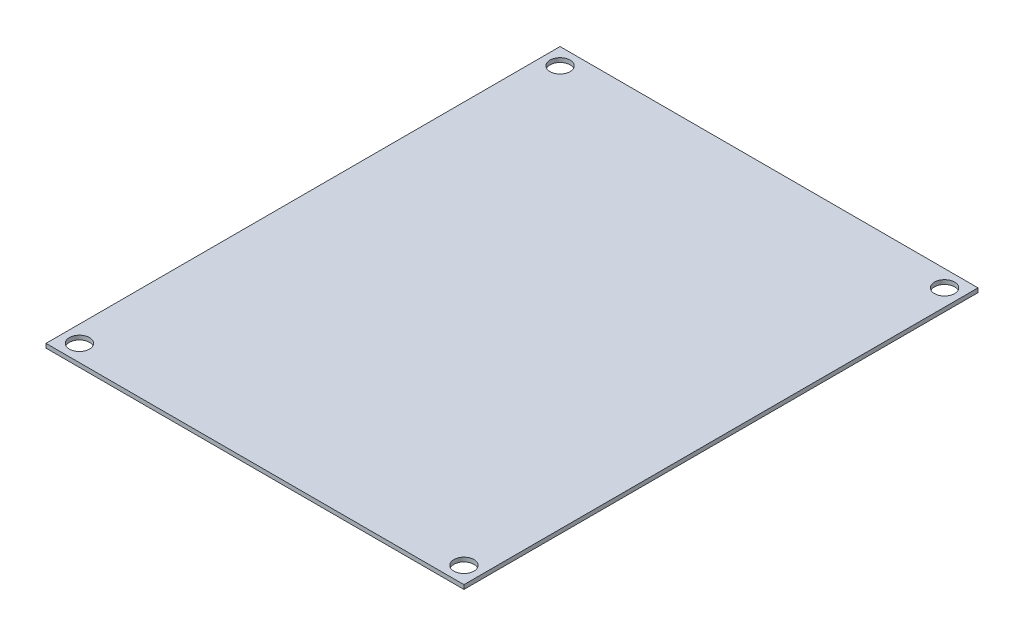
ISO-10303-21;
HEADER;
FILE_DESCRIPTION(('STEP AP214'),'2;1');
FILE_NAME('part.step','',(''),(''),'','','');
FILE_SCHEMA(('AUTOMOTIVE_DESIGN { 1 0 10303 214 1 1 1 1 }'));
ENDSEC;
DATA;
#1=APPLICATION_CONTEXT('core data for automotive mechanical design processes');
#2=APPLICATION_PROTOCOL_DEFINITION('international standard','automotive_design',2000,#1);
#3=PRODUCT_CONTEXT('',#1,'mechanical');
#4=PRODUCT('Part','Part','',(#3));
#5=PRODUCT_RELATED_PRODUCT_CATEGORY('part','',(#4));
#6=PRODUCT_DEFINITION_FORMATION('','',#4);
#7=PRODUCT_DEFINITION_CONTEXT('part definition',#1,'design');
#8=PRODUCT_DEFINITION('design','',#6,#7);
#9=PRODUCT_DEFINITION_SHAPE('','',#8);
#10=(LENGTH_UNIT() NAMED_UNIT(*) SI_UNIT(.MILLI.,.METRE.));
#11=(NAMED_UNIT(*) PLANE_ANGLE_UNIT() SI_UNIT($,.RADIAN.));
#12=(NAMED_UNIT(*) SI_UNIT($,.STERADIAN.) SOLID_ANGLE_UNIT());
#13=UNCERTAINTY_MEASURE_WITH_UNIT(LENGTH_MEASURE(1.E-05),#10,'distance_accuracy_value','');
#14=(GEOMETRIC_REPRESENTATION_CONTEXT(3) GLOBAL_UNCERTAINTY_ASSIGNED_CONTEXT((#13)) GLOBAL_UNIT_ASSIGNED_CONTEXT((#10,
#11,#12)) REPRESENTATION_CONTEXT('',''));
#15=CARTESIAN_POINT('',(0.,0.,0.));
#16=DIRECTION('',(0.,0.,1.));
#17=DIRECTION('',(1.,0.,0.));
#18=AXIS2_PLACEMENT_3D('',#15,#16,#17);
#19=CARTESIAN_POINT('',(-50.,1.,-61.5));
#20=DIRECTION('',(1.,0.,0.));
#21=DIRECTION('',(0.,0.,-1.));
#22=AXIS2_PLACEMENT_3D('',#19,#20,#21);
#23=PLANE('',#22);
#24=DIRECTION('',(0.,0.,1.));
#25=VECTOR('',#24,1.);
#26=CARTESIAN_POINT('',(-50.,0.,-61.5));
#27=LINE('',#26,#25);
#28=CARTESIAN_POINT('',(-50.,0.,-61.5));
#29=VERTEX_POINT('',#28);
#30=CARTESIAN_POINT('',(-50.,0.,61.5));
#31=VERTEX_POINT('',#30);
#32=EDGE_CURVE('E96',#29,#31,#27,.T.);
#33=ORIENTED_EDGE('',*,*,#32,.T.);
#34=DIRECTION('',(0.,-1.,0.));
#35=VECTOR('',#34,1.);
#36=CARTESIAN_POINT('',(-50.,1.,61.5));
#37=LINE('',#36,#35);
#38=CARTESIAN_POINT('',(-50.,1.,61.5));
#39=VERTEX_POINT('',#38);
#40=EDGE_CURVE('E11',#39,#31,#37,.T.);
#41=ORIENTED_EDGE('',*,*,#40,.F.);
#42=DIRECTION('',(0.,0.,1.));
#43=VECTOR('',#42,1.);
#44=CARTESIAN_POINT('',(-50.,1.,-61.5));
#45=LINE('',#44,#43);
#46=CARTESIAN_POINT('',(-50.,1.,-61.5));
#47=VERTEX_POINT('',#46);
#48=EDGE_CURVE('E84',#47,#39,#45,.T.);
#49=ORIENTED_EDGE('',*,*,#48,.F.);
#50=DIRECTION('',(0.,-1.,0.));
#51=VECTOR('',#50,1.);
#52=CARTESIAN_POINT('',(-50.,1.,-61.5));
#53=LINE('',#52,#51);
#54=EDGE_CURVE('E92',#47,#29,#53,.T.);
#55=ORIENTED_EDGE('',*,*,#54,.T.);
#56=EDGE_LOOP('',(#33,#41,#49,#55));
#57=FACE_BOUND('',#56,.T.);
#58=ADVANCED_FACE('F33',(#57),#23,.F.);
#59=CARTESIAN_POINT('',(50.,1.,61.5));
#60=DIRECTION('',(0.,0.,-1.));
#61=DIRECTION('',(-1.,0.,0.));
#62=AXIS2_PLACEMENT_3D('',#59,#60,#61);
#63=PLANE('',#62);
#64=DIRECTION('',(1.,0.,0.));
#65=VECTOR('',#64,1.);
#66=CARTESIAN_POINT('',(50.,0.,61.5));
#67=LINE('',#66,#65);
#68=CARTESIAN_POINT('',(50.,0.,61.5));
#69=VERTEX_POINT('',#68);
#70=EDGE_CURVE('E88',#31,#69,#67,.T.);
#71=ORIENTED_EDGE('',*,*,#70,.T.);
#72=DIRECTION('',(0.,-1.,0.));
#73=VECTOR('',#72,1.);
#74=CARTESIAN_POINT('',(50.,1.,61.5));
#75=LINE('',#74,#73);
#76=CARTESIAN_POINT('',(50.,1.,61.5));
#77=VERTEX_POINT('',#76);
#78=EDGE_CURVE('E41',#77,#69,#75,.T.);
#79=ORIENTED_EDGE('',*,*,#78,.F.);
#80=DIRECTION('',(1.,0.,0.));
#81=VECTOR('',#80,1.);
#82=CARTESIAN_POINT('',(50.,1.,61.5));
#83=LINE('',#82,#81);
#84=EDGE_CURVE('E79',#39,#77,#83,.T.);
#85=ORIENTED_EDGE('',*,*,#84,.F.);
#86=ORIENTED_EDGE('',*,*,#40,.T.);
#87=EDGE_LOOP('',(#71,#79,#85,#86));
#88=FACE_BOUND('',#87,.T.);
#89=ADVANCED_FACE('F87',(#88),#63,.F.);
#90=CARTESIAN_POINT('',(50.,1.,-61.5));
#91=DIRECTION('',(-1.,0.,0.));
#92=DIRECTION('',(0.,0.,1.));
#93=AXIS2_PLACEMENT_3D('',#90,#91,#92);
#94=PLANE('',#93);
#95=DIRECTION('',(0.,0.,-1.));
#96=VECTOR('',#95,1.);
#97=CARTESIAN_POINT('',(50.,0.,-61.5));
#98=LINE('',#97,#96);
#99=CARTESIAN_POINT('',(50.,0.,-61.5));
#100=VERTEX_POINT('',#99);
#101=EDGE_CURVE('E66',#69,#100,#98,.T.);
#102=ORIENTED_EDGE('',*,*,#101,.T.);
#103=DIRECTION('',(0.,-1.,0.));
#104=VECTOR('',#103,1.);
#105=CARTESIAN_POINT('',(50.,1.,-61.5));
#106=LINE('',#105,#104);
#107=CARTESIAN_POINT('',(50.,1.,-61.5));
#108=VERTEX_POINT('',#107);
#109=EDGE_CURVE('E89',#108,#100,#106,.T.);
#110=ORIENTED_EDGE('',*,*,#109,.F.);
#111=DIRECTION('',(0.,0.,-1.));
#112=VECTOR('',#111,1.);
#113=CARTESIAN_POINT('',(50.,1.,-61.5));
#114=LINE('',#113,#112);
#115=EDGE_CURVE('E82',#77,#108,#114,.T.);
#116=ORIENTED_EDGE('',*,*,#115,.F.);
#117=ORIENTED_EDGE('',*,*,#78,.T.);
#118=EDGE_LOOP('',(#102,#110,#116,#117));
#119=FACE_BOUND('',#118,.T.);
#120=ADVANCED_FACE('F90',(#119),#94,.F.);
#121=CARTESIAN_POINT('',(50.,1.,-61.5));
#122=DIRECTION('',(0.,0.,1.));
#123=DIRECTION('',(1.,0.,0.));
#124=AXIS2_PLACEMENT_3D('',#121,#122,#123);
#125=PLANE('',#124);
#126=DIRECTION('',(-1.,0.,0.));
#127=VECTOR('',#126,1.);
#128=CARTESIAN_POINT('',(50.,0.,-61.5));
#129=LINE('',#128,#127);
#130=EDGE_CURVE('E72',#100,#29,#129,.T.);
#131=ORIENTED_EDGE('',*,*,#130,.T.);
#132=ORIENTED_EDGE('',*,*,#54,.F.);
#133=DIRECTION('',(-1.,0.,0.));
#134=VECTOR('',#133,1.);
#135=CARTESIAN_POINT('',(50.,1.,-61.5));
#136=LINE('',#135,#134);
#137=EDGE_CURVE('E49',#108,#47,#136,.T.);
#138=ORIENTED_EDGE('',*,*,#137,.F.);
#139=ORIENTED_EDGE('',*,*,#109,.T.);
#140=EDGE_LOOP('',(#131,#132,#138,#139));
#141=FACE_BOUND('',#140,.T.);
#142=ADVANCED_FACE('F104',(#141),#125,.F.);
#143=CARTESIAN_POINT('',(0.,1.,0.));
#144=DIRECTION('',(0.,-1.,0.));
#145=DIRECTION('',(0.,0.,-1.));
#146=AXIS2_PLACEMENT_3D('',#143,#144,#145);
#147=PLANE('',#146);
#148=CARTESIAN_POINT('',(-46.,1.,57.5));
#149=DIRECTION('',(0.,1.,0.));
#150=DIRECTION('',(0.,0.,1.));
#151=AXIS2_PLACEMENT_3D('',#148,#149,#150);
#152=CIRCLE('',#151,2.4);
#153=CARTESIAN_POINT('',(-46.,1.,59.9));
#154=VERTEX_POINT('',#153);
#155=EDGE_CURVE('E130',#154,#154,#152,.T.);
#156=ORIENTED_EDGE('',*,*,#155,.F.);
#157=EDGE_LOOP('',(#156));
#158=FACE_BOUND('',#157,.T.);
#159=CARTESIAN_POINT('',(-46.,1.,-57.5));
#160=DIRECTION('',(0.,1.,0.));
#161=DIRECTION('',(0.,0.,1.));
#162=AXIS2_PLACEMENT_3D('',#159,#160,#161);
#163=CIRCLE('',#162,2.4);
#164=CARTESIAN_POINT('',(-46.,1.,-55.1));
#165=VERTEX_POINT('',#164);
#166=EDGE_CURVE('E124',#165,#165,#163,.T.);
#167=ORIENTED_EDGE('',*,*,#166,.F.);
#168=EDGE_LOOP('',(#167));
#169=FACE_BOUND('',#168,.T.);
#170=CARTESIAN_POINT('',(46.,1.,-57.5));
#171=DIRECTION('',(0.,1.,0.));
#172=DIRECTION('',(0.,0.,1.));
#173=AXIS2_PLACEMENT_3D('',#170,#171,#172);
#174=CIRCLE('',#173,2.4);
#175=CARTESIAN_POINT('',(46.,1.,-55.1));
#176=VERTEX_POINT('',#175);
#177=EDGE_CURVE('E118',#176,#176,#174,.T.);
#178=ORIENTED_EDGE('',*,*,#177,.F.);
#179=EDGE_LOOP('',(#178));
#180=FACE_BOUND('',#179,.T.);
#181=CARTESIAN_POINT('',(46.,1.,57.5));
#182=DIRECTION('',(0.,1.,0.));
#183=DIRECTION('',(0.,0.,1.));
#184=AXIS2_PLACEMENT_3D('',#181,#182,#183);
#185=CIRCLE('',#184,2.4);
#186=CARTESIAN_POINT('',(46.,1.,59.9));
#187=VERTEX_POINT('',#186);
#188=EDGE_CURVE('E112',#187,#187,#185,.T.);
#189=ORIENTED_EDGE('',*,*,#188,.F.);
#190=EDGE_LOOP('',(#189));
#191=FACE_BOUND('',#190,.T.);
#192=ORIENTED_EDGE('',*,*,#48,.T.);
#193=ORIENTED_EDGE('',*,*,#84,.T.);
#194=ORIENTED_EDGE('',*,*,#115,.T.);
#195=ORIENTED_EDGE('',*,*,#137,.T.);
#196=EDGE_LOOP('',(#192,#193,#194,#195));
#197=FACE_BOUND('',#196,.T.);
#198=ADVANCED_FACE('F80',(#158,#169,#180,#191,#197),#147,.F.);
#199=CARTESIAN_POINT('',(0.,0.,0.));
#200=DIRECTION('',(0.,-1.,0.));
#201=DIRECTION('',(0.,0.,-1.));
#202=AXIS2_PLACEMENT_3D('',#199,#200,#201);
#203=PLANE('',#202);
#204=CARTESIAN_POINT('',(-46.,0.,57.5));
#205=DIRECTION('',(0.,1.,0.));
#206=DIRECTION('',(0.,0.,1.));
#207=AXIS2_PLACEMENT_3D('',#204,#205,#206);
#208=CIRCLE('',#207,2.4);
#209=CARTESIAN_POINT('',(-46.,0.,59.9));
#210=VERTEX_POINT('',#209);
#211=EDGE_CURVE('E127',#210,#210,#208,.T.);
#212=ORIENTED_EDGE('',*,*,#211,.T.);
#213=EDGE_LOOP('',(#212));
#214=FACE_BOUND('',#213,.T.);
#215=CARTESIAN_POINT('',(-46.,0.,-57.5));
#216=DIRECTION('',(0.,1.,0.));
#217=DIRECTION('',(0.,0.,1.));
#218=AXIS2_PLACEMENT_3D('',#215,#216,#217);
#219=CIRCLE('',#218,2.4);
#220=CARTESIAN_POINT('',(-46.,0.,-55.1));
#221=VERTEX_POINT('',#220);
#222=EDGE_CURVE('E121',#221,#221,#219,.T.);
#223=ORIENTED_EDGE('',*,*,#222,.T.);
#224=EDGE_LOOP('',(#223));
#225=FACE_BOUND('',#224,.T.);
#226=CARTESIAN_POINT('',(46.,0.,-57.5));
#227=DIRECTION('',(0.,1.,0.));
#228=DIRECTION('',(0.,0.,1.));
#229=AXIS2_PLACEMENT_3D('',#226,#227,#228);
#230=CIRCLE('',#229,2.4);
#231=CARTESIAN_POINT('',(46.,0.,-55.1));
#232=VERTEX_POINT('',#231);
#233=EDGE_CURVE('E115',#232,#232,#230,.T.);
#234=ORIENTED_EDGE('',*,*,#233,.T.);
#235=EDGE_LOOP('',(#234));
#236=FACE_BOUND('',#235,.T.);
#237=CARTESIAN_POINT('',(46.,0.,57.5));
#238=DIRECTION('',(0.,1.,0.));
#239=DIRECTION('',(0.,0.,1.));
#240=AXIS2_PLACEMENT_3D('',#237,#238,#239);
#241=CIRCLE('',#240,2.4);
#242=CARTESIAN_POINT('',(46.,0.,59.9));
#243=VERTEX_POINT('',#242);
#244=EDGE_CURVE('E99',#243,#243,#241,.T.);
#245=ORIENTED_EDGE('',*,*,#244,.T.);
#246=EDGE_LOOP('',(#245));
#247=FACE_BOUND('',#246,.T.);
#248=ORIENTED_EDGE('',*,*,#32,.F.);
#249=ORIENTED_EDGE('',*,*,#130,.F.);
#250=ORIENTED_EDGE('',*,*,#101,.F.);
#251=ORIENTED_EDGE('',*,*,#70,.F.);
#252=EDGE_LOOP('',(#248,#249,#250,#251));
#253=FACE_BOUND('',#252,.T.);
#254=ADVANCED_FACE('F107',(#214,#225,#236,#247,#253),#203,.T.);
#255=CARTESIAN_POINT('',(46.,1.,57.5));
#256=DIRECTION('',(0.,1.,0.));
#257=DIRECTION('',(0.,0.,1.));
#258=AXIS2_PLACEMENT_3D('',#255,#256,#257);
#259=CYLINDRICAL_SURFACE('',#258,2.4);
#260=ORIENTED_EDGE('',*,*,#244,.F.);
#261=EDGE_LOOP('',(#260));
#262=FACE_BOUND('',#261,.T.);
#263=ORIENTED_EDGE('',*,*,#188,.T.);
#264=EDGE_LOOP('',(#263));
#265=FACE_BOUND('',#264,.T.);
#266=ADVANCED_FACE('F145',(#262,#265),#259,.F.);
#267=CARTESIAN_POINT('',(46.,1.,-57.5));
#268=DIRECTION('',(0.,1.,0.));
#269=DIRECTION('',(0.,0.,1.));
#270=AXIS2_PLACEMENT_3D('',#267,#268,#269);
#271=CYLINDRICAL_SURFACE('',#270,2.4);
#272=ORIENTED_EDGE('',*,*,#233,.F.);
#273=EDGE_LOOP('',(#272));
#274=FACE_BOUND('',#273,.T.);
#275=ORIENTED_EDGE('',*,*,#177,.T.);
#276=EDGE_LOOP('',(#275));
#277=FACE_BOUND('',#276,.T.);
#278=ADVANCED_FACE('F147',(#274,#277),#271,.F.);
#279=CARTESIAN_POINT('',(-46.,1.,-57.5));
#280=DIRECTION('',(0.,1.,0.));
#281=DIRECTION('',(0.,0.,1.));
#282=AXIS2_PLACEMENT_3D('',#279,#280,#281);
#283=CYLINDRICAL_SURFACE('',#282,2.4);
#284=ORIENTED_EDGE('',*,*,#222,.F.);
#285=EDGE_LOOP('',(#284));
#286=FACE_BOUND('',#285,.T.);
#287=ORIENTED_EDGE('',*,*,#166,.T.);
#288=EDGE_LOOP('',(#287));
#289=FACE_BOUND('',#288,.T.);
#290=ADVANCED_FACE('F154',(#286,#289),#283,.F.);
#291=CARTESIAN_POINT('',(-46.,1.,57.5));
#292=DIRECTION('',(0.,1.,0.));
#293=DIRECTION('',(0.,0.,1.));
#294=AXIS2_PLACEMENT_3D('',#291,#292,#293);
#295=CYLINDRICAL_SURFACE('',#294,2.4);
#296=ORIENTED_EDGE('',*,*,#211,.F.);
#297=EDGE_LOOP('',(#296));
#298=FACE_BOUND('',#297,.T.);
#299=ORIENTED_EDGE('',*,*,#155,.T.);
#300=EDGE_LOOP('',(#299));
#301=FACE_BOUND('',#300,.T.);
#302=ADVANCED_FACE('F134',(#298,#301),#295,.F.);
#303=CLOSED_SHELL('',(#58,#89,#120,#142,#198,#254,#266,#278,#290,#302));
#304=MANIFOLD_SOLID_BREP('B2',#303);
#305=ADVANCED_BREP_SHAPE_REPRESENTATION('',(#18,#304),#14);
#306=SHAPE_DEFINITION_REPRESENTATION(#9,#305);
ENDSEC;
END-ISO-10303-21;
